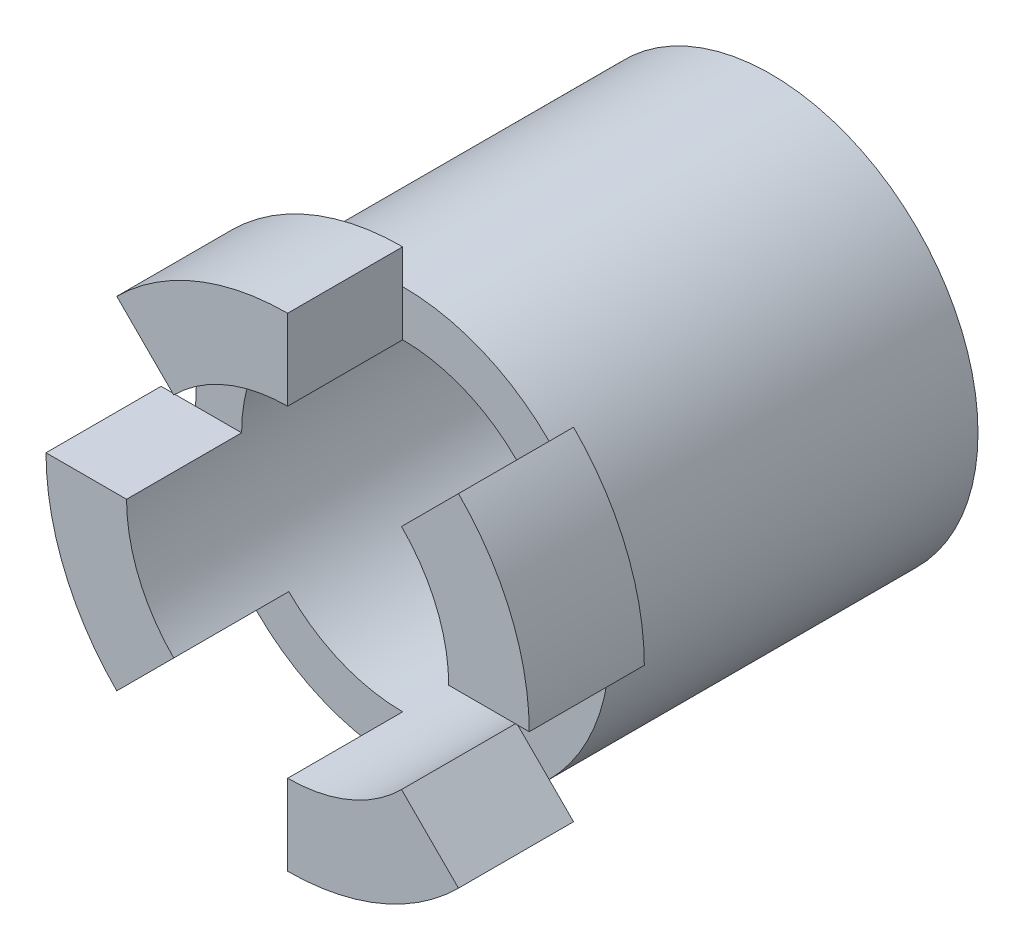
ISO-10303-21;
HEADER;
FILE_DESCRIPTION(('STEP AP214'),'2;1');
FILE_NAME('part.step','',(''),(''),'','','');
FILE_SCHEMA(('AUTOMOTIVE_DESIGN { 1 0 10303 214 1 1 1 1 }'));
ENDSEC;
DATA;
#1=APPLICATION_CONTEXT('core data for automotive mechanical design processes');
#2=APPLICATION_PROTOCOL_DEFINITION('international standard','automotive_design',2000,#1);
#3=PRODUCT_CONTEXT('',#1,'mechanical');
#4=PRODUCT('Part','Part','',(#3));
#5=PRODUCT_RELATED_PRODUCT_CATEGORY('part','',(#4));
#6=PRODUCT_DEFINITION_FORMATION('','',#4);
#7=PRODUCT_DEFINITION_CONTEXT('part definition',#1,'design');
#8=PRODUCT_DEFINITION('design','',#6,#7);
#9=PRODUCT_DEFINITION_SHAPE('','',#8);
#10=(LENGTH_UNIT() NAMED_UNIT(*) SI_UNIT(.MILLI.,.METRE.));
#11=(NAMED_UNIT(*) PLANE_ANGLE_UNIT() SI_UNIT($,.RADIAN.));
#12=(NAMED_UNIT(*) SI_UNIT($,.STERADIAN.) SOLID_ANGLE_UNIT());
#13=UNCERTAINTY_MEASURE_WITH_UNIT(LENGTH_MEASURE(1.E-05),#10,'distance_accuracy_value','');
#14=(GEOMETRIC_REPRESENTATION_CONTEXT(3) GLOBAL_UNCERTAINTY_ASSIGNED_CONTEXT((#13)) GLOBAL_UNIT_ASSIGNED_CONTEXT((#10,
#11,#12)) REPRESENTATION_CONTEXT('',''));
#15=CARTESIAN_POINT('',(0.,0.,0.));
#16=DIRECTION('',(0.,0.,1.));
#17=DIRECTION('',(1.,0.,0.));
#18=AXIS2_PLACEMENT_3D('',#15,#16,#17);
#19=CARTESIAN_POINT('',(0.,0.,8.));
#20=DIRECTION('',(0.,0.,1.));
#21=DIRECTION('',(1.,0.,0.));
#22=AXIS2_PLACEMENT_3D('',#19,#20,#21);
#23=PLANE('',#22);
#24=CARTESIAN_POINT('',(0.,0.,8.));
#25=DIRECTION('',(0.,0.,1.));
#26=DIRECTION('',(1.,0.,0.));
#27=AXIS2_PLACEMENT_3D('',#24,#25,#26);
#28=CIRCLE('',#27,3.5);
#29=CARTESIAN_POINT('',(2.4748737341529,2.47487373415293,8.));
#30=VERTEX_POINT('',#29);
#31=CARTESIAN_POINT('',(0.,3.5,8.));
#32=VERTEX_POINT('',#31);
#33=EDGE_CURVE('E343',#30,#32,#28,.T.);
#34=ORIENTED_EDGE('',*,*,#33,.F.);
#35=DIRECTION('',(-0.707106781186544,-0.707106781186551,0.));
#36=VECTOR('',#35,1.);
#37=CARTESIAN_POINT('',(2.4748737341529,2.47487373415293,8.));
#38=LINE('',#37,#36);
#39=CARTESIAN_POINT('',(3.18198051533944,3.18198051533948,8.));
#40=VERTEX_POINT('',#39);
#41=EDGE_CURVE('E696',#40,#30,#38,.T.);
#42=ORIENTED_EDGE('',*,*,#41,.F.);
#43=CARTESIAN_POINT('',(0.,0.,8.));
#44=DIRECTION('',(0.,0.,1.));
#45=DIRECTION('',(1.,0.,0.));
#46=AXIS2_PLACEMENT_3D('',#43,#44,#45);
#47=CIRCLE('',#46,4.5);
#48=CARTESIAN_POINT('',(0.,4.5,8.));
#49=VERTEX_POINT('',#48);
#50=EDGE_CURVE('E356',#40,#49,#47,.T.);
#51=ORIENTED_EDGE('',*,*,#50,.T.);
#52=DIRECTION('',(0.,1.,0.));
#53=VECTOR('',#52,1.);
#54=CARTESIAN_POINT('',(0.,5.25,8.));
#55=LINE('',#54,#53);
#56=EDGE_CURVE('E309',#32,#49,#55,.T.);
#57=ORIENTED_EDGE('',*,*,#56,.F.);
#58=EDGE_LOOP('',(#34,#42,#51,#57));
#59=FACE_BOUND('',#58,.T.);
#60=ADVANCED_FACE('F39',(#59),#23,.T.);
#61=CARTESIAN_POINT('',(3.18198051533946,-3.18198051533947,8.));
#62=VERTEX_POINT('',#61);
#63=CARTESIAN_POINT('',(4.5,0.,8.));
#64=VERTEX_POINT('',#63);
#65=EDGE_CURVE('E363',#62,#64,#47,.T.);
#66=ORIENTED_EDGE('',*,*,#65,.T.);
#67=DIRECTION('',(1.,0.,0.));
#68=VECTOR('',#67,1.);
#69=CARTESIAN_POINT('',(3.5,0.,8.));
#70=LINE('',#69,#68);
#71=CARTESIAN_POINT('',(3.5,0.,8.));
#72=VERTEX_POINT('',#71);
#73=EDGE_CURVE('E200',#72,#64,#70,.T.);
#74=ORIENTED_EDGE('',*,*,#73,.F.);
#75=CARTESIAN_POINT('',(2.47487373415291,-2.47487373415292,8.));
#76=VERTEX_POINT('',#75);
#77=EDGE_CURVE('E352',#76,#72,#28,.T.);
#78=ORIENTED_EDGE('',*,*,#77,.F.);
#79=DIRECTION('',(-0.707106781186546,0.707106781186549,0.));
#80=VECTOR('',#79,1.);
#81=CARTESIAN_POINT('',(2.47487373415291,-2.47487373415292,8.));
#82=LINE('',#81,#80);
#83=EDGE_CURVE('E277',#62,#76,#82,.T.);
#84=ORIENTED_EDGE('',*,*,#83,.F.);
#85=EDGE_LOOP('',(#66,#74,#78,#84));
#86=FACE_BOUND('',#85,.T.);
#87=ADVANCED_FACE('F399',(#86),#23,.T.);
#88=CARTESIAN_POINT('',(-2.4748737341529,-2.47487373415293,8.));
#89=VERTEX_POINT('',#88);
#90=CARTESIAN_POINT('',(0.,-3.5,8.));
#91=VERTEX_POINT('',#90);
#92=EDGE_CURVE('E351',#89,#91,#28,.T.);
#93=ORIENTED_EDGE('',*,*,#92,.F.);
#94=DIRECTION('',(0.707106781186544,0.707106781186551,0.));
#95=VECTOR('',#94,1.);
#96=CARTESIAN_POINT('',(-3.71231060122935,-3.7123106012294,8.));
#97=LINE('',#96,#95);
#98=CARTESIAN_POINT('',(-3.18198051533945,-3.18198051533948,8.));
#99=VERTEX_POINT('',#98);
#100=EDGE_CURVE('E234',#99,#89,#97,.T.);
#101=ORIENTED_EDGE('',*,*,#100,.F.);
#102=CARTESIAN_POINT('',(0.,-4.5,8.));
#103=VERTEX_POINT('',#102);
#104=EDGE_CURVE('E362',#99,#103,#47,.T.);
#105=ORIENTED_EDGE('',*,*,#104,.T.);
#106=DIRECTION('',(0.,-1.,0.));
#107=VECTOR('',#106,1.);
#108=CARTESIAN_POINT('',(0.,-3.5,8.));
#109=LINE('',#108,#107);
#110=EDGE_CURVE('E264',#91,#103,#109,.T.);
#111=ORIENTED_EDGE('',*,*,#110,.F.);
#112=EDGE_LOOP('',(#93,#101,#105,#111));
#113=FACE_BOUND('',#112,.T.);
#114=ADVANCED_FACE('F380',(#113),#23,.T.);
#115=CARTESIAN_POINT('',(-3.18198051533946,3.18198051533947,8.));
#116=VERTEX_POINT('',#115);
#117=CARTESIAN_POINT('',(-4.5,0.,8.));
#118=VERTEX_POINT('',#117);
#119=EDGE_CURVE('E355',#116,#118,#47,.T.);
#120=ORIENTED_EDGE('',*,*,#119,.T.);
#121=DIRECTION('',(-1.,0.,0.));
#122=VECTOR('',#121,1.);
#123=CARTESIAN_POINT('',(-5.25,0.,8.));
#124=LINE('',#123,#122);
#125=CARTESIAN_POINT('',(-3.5,0.,8.));
#126=VERTEX_POINT('',#125);
#127=EDGE_CURVE('E221',#126,#118,#124,.T.);
#128=ORIENTED_EDGE('',*,*,#127,.F.);
#129=CARTESIAN_POINT('',(-2.47487373415291,2.47487373415292,8.));
#130=VERTEX_POINT('',#129);
#131=EDGE_CURVE('E348',#130,#126,#28,.T.);
#132=ORIENTED_EDGE('',*,*,#131,.F.);
#133=DIRECTION('',(0.707106781186546,-0.707106781186549,0.));
#134=VECTOR('',#133,1.);
#135=CARTESIAN_POINT('',(-3.71231060122937,3.71231060122938,8.));
#136=LINE('',#135,#134);
#137=EDGE_CURVE('E11',#116,#130,#136,.T.);
#138=ORIENTED_EDGE('',*,*,#137,.F.);
#139=EDGE_LOOP('',(#120,#128,#132,#138));
#140=FACE_BOUND('',#139,.T.);
#141=ADVANCED_FACE('F432',(#140),#23,.T.);
#142=CARTESIAN_POINT('',(0.,0.,8.));
#143=DIRECTION('',(0.,0.,-1.));
#144=DIRECTION('',(-1.,0.,0.));
#145=AXIS2_PLACEMENT_3D('',#142,#143,#144);
#146=CYLINDRICAL_SURFACE('',#145,4.5);
#147=EDGE_CURVE('E49',#49,#116,#47,.T.);
#148=ORIENTED_EDGE('',*,*,#147,.F.);
#149=ORIENTED_EDGE('',*,*,#50,.F.);
#150=CARTESIAN_POINT('',(0.,0.,8.));
#151=DIRECTION('',(0.,0.,1.));
#152=DIRECTION('',(1.,0.,0.));
#153=AXIS2_PLACEMENT_3D('',#150,#151,#152);
#154=CIRCLE('',#153,4.5);
#155=EDGE_CURVE('E206',#64,#40,#154,.T.);
#156=ORIENTED_EDGE('',*,*,#155,.F.);
#157=ORIENTED_EDGE('',*,*,#65,.F.);
#158=CARTESIAN_POINT('',(0.,0.,8.));
#159=DIRECTION('',(0.,0.,1.));
#160=DIRECTION('',(1.,0.,0.));
#161=AXIS2_PLACEMENT_3D('',#158,#159,#160);
#162=CIRCLE('',#161,4.5);
#163=EDGE_CURVE('E300',#103,#62,#162,.T.);
#164=ORIENTED_EDGE('',*,*,#163,.F.);
#165=ORIENTED_EDGE('',*,*,#104,.F.);
#166=CARTESIAN_POINT('',(0.,0.,8.));
#167=DIRECTION('',(0.,0.,1.));
#168=DIRECTION('',(1.,0.,0.));
#169=AXIS2_PLACEMENT_3D('',#166,#167,#168);
#170=CIRCLE('',#169,4.5);
#171=EDGE_CURVE('E255',#118,#99,#170,.T.);
#172=ORIENTED_EDGE('',*,*,#171,.F.);
#173=ORIENTED_EDGE('',*,*,#119,.F.);
#174=EDGE_LOOP('',(#148,#149,#156,#157,#164,#165,#172,#173));
#175=FACE_BOUND('',#174,.T.);
#176=CARTESIAN_POINT('',(0.,0.,0.));
#177=DIRECTION('',(0.,0.,1.));
#178=DIRECTION('',(1.,0.,0.));
#179=AXIS2_PLACEMENT_3D('',#176,#177,#178);
#180=CIRCLE('',#179,4.5);
#181=CARTESIAN_POINT('',(4.5,0.,0.));
#182=VERTEX_POINT('',#181);
#183=EDGE_CURVE('E43',#182,#182,#180,.T.);
#184=ORIENTED_EDGE('',*,*,#183,.T.);
#185=EDGE_LOOP('',(#184));
#186=FACE_BOUND('',#185,.T.);
#187=ADVANCED_FACE('F41',(#175,#186),#146,.T.);
#188=CARTESIAN_POINT('',(0.,0.,0.));
#189=DIRECTION('',(0.,0.,1.));
#190=DIRECTION('',(1.,0.,0.));
#191=AXIS2_PLACEMENT_3D('',#188,#189,#190);
#192=PLANE('',#191);
#193=ORIENTED_EDGE('',*,*,#183,.F.);
#194=EDGE_LOOP('',(#193));
#195=FACE_BOUND('',#194,.T.);
#196=ADVANCED_FACE('F468',(#195),#192,.F.);
#197=CARTESIAN_POINT('',(0.,0.,1.5));
#198=DIRECTION('',(0.,0.,1.));
#199=DIRECTION('',(1.,0.,0.));
#200=AXIS2_PLACEMENT_3D('',#197,#198,#199);
#201=CYLINDRICAL_SURFACE('',#200,3.5);
#202=CARTESIAN_POINT('',(0.,0.,1.5));
#203=DIRECTION('',(0.,0.,1.));
#204=DIRECTION('',(1.,0.,0.));
#205=AXIS2_PLACEMENT_3D('',#202,#203,#204);
#206=CIRCLE('',#205,3.5);
#207=CARTESIAN_POINT('',(3.5,0.,1.5));
#208=VERTEX_POINT('',#207);
#209=EDGE_CURVE('E344',#208,#208,#206,.T.);
#210=ORIENTED_EDGE('',*,*,#209,.F.);
#211=EDGE_LOOP('',(#210));
#212=FACE_BOUND('',#211,.T.);
#213=ORIENTED_EDGE('',*,*,#131,.T.);
#214=DIRECTION('',(0.,0.,-1.));
#215=VECTOR('',#214,1.);
#216=CARTESIAN_POINT('',(-3.5,0.,10.5));
#217=LINE('',#216,#215);
#218=CARTESIAN_POINT('',(-3.5,0.,10.5));
#219=VERTEX_POINT('',#218);
#220=EDGE_CURVE('E246',#219,#126,#217,.T.);
#221=ORIENTED_EDGE('',*,*,#220,.F.);
#222=CARTESIAN_POINT('',(0.,0.,10.5));
#223=DIRECTION('',(0.,0.,-1.));
#224=DIRECTION('',(1.,0.,0.));
#225=AXIS2_PLACEMENT_3D('',#222,#223,#224);
#226=CIRCLE('',#225,3.5);
#227=CARTESIAN_POINT('',(-2.4748737341529,-2.47487373415293,10.5));
#228=VERTEX_POINT('',#227);
#229=EDGE_CURVE('E224',#228,#219,#226,.T.);
#230=ORIENTED_EDGE('',*,*,#229,.F.);
#231=DIRECTION('',(0.,0.,-1.));
#232=VECTOR('',#231,1.);
#233=CARTESIAN_POINT('',(-2.4748737341529,-2.47487373415293,10.5));
#234=LINE('',#233,#232);
#235=EDGE_CURVE('E65',#228,#89,#234,.T.);
#236=ORIENTED_EDGE('',*,*,#235,.T.);
#237=ORIENTED_EDGE('',*,*,#92,.T.);
#238=DIRECTION('',(0.,0.,-1.));
#239=VECTOR('',#238,1.);
#240=CARTESIAN_POINT('',(0.,-3.5,10.5));
#241=LINE('',#240,#239);
#242=CARTESIAN_POINT('',(0.,-3.5,10.5));
#243=VERTEX_POINT('',#242);
#244=EDGE_CURVE('E289',#243,#91,#241,.T.);
#245=ORIENTED_EDGE('',*,*,#244,.F.);
#246=CARTESIAN_POINT('',(0.,0.,10.5));
#247=DIRECTION('',(0.,0.,-1.));
#248=DIRECTION('',(1.,0.,0.));
#249=AXIS2_PLACEMENT_3D('',#246,#247,#248);
#250=CIRCLE('',#249,3.5);
#251=CARTESIAN_POINT('',(2.47487373415291,-2.47487373415292,10.5));
#252=VERTEX_POINT('',#251);
#253=EDGE_CURVE('E267',#252,#243,#250,.T.);
#254=ORIENTED_EDGE('',*,*,#253,.F.);
#255=DIRECTION('',(0.,0.,-1.));
#256=VECTOR('',#255,1.);
#257=CARTESIAN_POINT('',(2.47487373415291,-2.47487373415292,10.5));
#258=LINE('',#257,#256);
#259=EDGE_CURVE('E293',#252,#76,#258,.T.);
#260=ORIENTED_EDGE('',*,*,#259,.T.);
#261=ORIENTED_EDGE('',*,*,#77,.T.);
#262=DIRECTION('',(0.,0.,-1.));
#263=VECTOR('',#262,1.);
#264=CARTESIAN_POINT('',(3.5,0.,10.5));
#265=LINE('',#264,#263);
#266=CARTESIAN_POINT('',(3.5,0.,10.5));
#267=VERTEX_POINT('',#266);
#268=EDGE_CURVE('E212',#267,#72,#265,.T.);
#269=ORIENTED_EDGE('',*,*,#268,.F.);
#270=CARTESIAN_POINT('',(0.,0.,10.5));
#271=DIRECTION('',(0.,0.,-1.));
#272=DIRECTION('',(1.,0.,0.));
#273=AXIS2_PLACEMENT_3D('',#270,#271,#272);
#274=CIRCLE('',#273,3.5);
#275=CARTESIAN_POINT('',(2.4748737341529,2.47487373415293,10.5));
#276=VERTEX_POINT('',#275);
#277=EDGE_CURVE('E189',#276,#267,#274,.T.);
#278=ORIENTED_EDGE('',*,*,#277,.F.);
#279=DIRECTION('',(0.,0.,-1.));
#280=VECTOR('',#279,1.);
#281=CARTESIAN_POINT('',(2.4748737341529,2.47487373415293,10.5));
#282=LINE('',#281,#280);
#283=EDGE_CURVE('E58',#276,#30,#282,.T.);
#284=ORIENTED_EDGE('',*,*,#283,.T.);
#285=ORIENTED_EDGE('',*,*,#33,.T.);
#286=DIRECTION('',(0.,0.,-1.));
#287=VECTOR('',#286,1.);
#288=CARTESIAN_POINT('',(0.,3.5,10.5));
#289=LINE('',#288,#287);
#290=CARTESIAN_POINT('',(0.,3.5,10.5));
#291=VERTEX_POINT('',#290);
#292=EDGE_CURVE('E331',#291,#32,#289,.T.);
#293=ORIENTED_EDGE('',*,*,#292,.F.);
#294=CARTESIAN_POINT('',(0.,0.,10.5));
#295=DIRECTION('',(0.,0.,-1.));
#296=DIRECTION('',(1.,0.,0.));
#297=AXIS2_PLACEMENT_3D('',#294,#295,#296);
#298=CIRCLE('',#297,3.5);
#299=CARTESIAN_POINT('',(-2.47487373415291,2.47487373415292,10.5));
#300=VERTEX_POINT('',#299);
#301=EDGE_CURVE('E312',#300,#291,#298,.T.);
#302=ORIENTED_EDGE('',*,*,#301,.F.);
#303=DIRECTION('',(0.,0.,-1.));
#304=VECTOR('',#303,1.);
#305=CARTESIAN_POINT('',(-2.47487373415291,2.47487373415292,10.5));
#306=LINE('',#305,#304);
#307=EDGE_CURVE('E335',#300,#130,#306,.T.);
#308=ORIENTED_EDGE('',*,*,#307,.T.);
#309=EDGE_LOOP('',(#213,#221,#230,#236,#237,#245,#254,#260,#261,#269,#278,#284,#285,#293,#302,#308));
#310=FACE_BOUND('',#309,.T.);
#311=ADVANCED_FACE('F416',(#212,#310),#201,.F.);
#312=CARTESIAN_POINT('',(0.,0.,1.5));
#313=DIRECTION('',(0.,0.,1.));
#314=DIRECTION('',(1.,0.,0.));
#315=AXIS2_PLACEMENT_3D('',#312,#313,#314);
#316=PLANE('',#315);
#317=ORIENTED_EDGE('',*,*,#209,.T.);
#318=EDGE_LOOP('',(#317));
#319=FACE_BOUND('',#318,.T.);
#320=ADVANCED_FACE('F485',(#319),#316,.T.);
#321=CARTESIAN_POINT('',(0.,0.,8.));
#322=DIRECTION('',(0.,0.,1.));
#323=DIRECTION('',(1.,0.,0.));
#324=AXIS2_PLACEMENT_3D('',#321,#322,#323);
#325=PLANE('',#324);
#326=CARTESIAN_POINT('',(0.,5.25,8.));
#327=VERTEX_POINT('',#326);
#328=EDGE_CURVE('E324',#49,#327,#55,.T.);
#329=ORIENTED_EDGE('',*,*,#328,.F.);
#330=ORIENTED_EDGE('',*,*,#147,.T.);
#331=CARTESIAN_POINT('',(-3.71231060122937,3.71231060122938,8.));
#332=VERTEX_POINT('',#331);
#333=EDGE_CURVE('E51',#332,#116,#136,.T.);
#334=ORIENTED_EDGE('',*,*,#333,.F.);
#335=CARTESIAN_POINT('',(0.,0.,8.));
#336=DIRECTION('',(0.,0.,1.));
#337=DIRECTION('',(1.,0.,0.));
#338=AXIS2_PLACEMENT_3D('',#335,#336,#337);
#339=CIRCLE('',#338,5.25);
#340=EDGE_CURVE('E303',#327,#332,#339,.T.);
#341=ORIENTED_EDGE('',*,*,#340,.F.);
#342=EDGE_LOOP('',(#329,#330,#334,#341));
#343=FACE_BOUND('',#342,.T.);
#344=ADVANCED_FACE('F490',(#343),#325,.F.);
#345=CARTESIAN_POINT('',(0.,0.,10.5));
#346=DIRECTION('',(0.,0.,-1.));
#347=DIRECTION('',(-1.,0.,0.));
#348=AXIS2_PLACEMENT_3D('',#345,#346,#347);
#349=CYLINDRICAL_SURFACE('',#348,5.25);
#350=ORIENTED_EDGE('',*,*,#340,.T.);
#351=DIRECTION('',(0.,0.,-1.));
#352=VECTOR('',#351,1.);
#353=CARTESIAN_POINT('',(-3.71231060122937,3.71231060122938,10.5));
#354=LINE('',#353,#352);
#355=CARTESIAN_POINT('',(-3.71231060122937,3.71231060122938,10.5));
#356=VERTEX_POINT('',#355);
#357=EDGE_CURVE('E339',#356,#332,#354,.T.);
#358=ORIENTED_EDGE('',*,*,#357,.F.);
#359=CARTESIAN_POINT('',(0.,0.,10.5));
#360=DIRECTION('',(0.,0.,1.));
#361=DIRECTION('',(1.,0.,0.));
#362=AXIS2_PLACEMENT_3D('',#359,#360,#361);
#363=CIRCLE('',#362,5.25);
#364=CARTESIAN_POINT('',(0.,5.25,10.5));
#365=VERTEX_POINT('',#364);
#366=EDGE_CURVE('E304',#365,#356,#363,.T.);
#367=ORIENTED_EDGE('',*,*,#366,.F.);
#368=DIRECTION('',(0.,0.,-1.));
#369=VECTOR('',#368,1.);
#370=CARTESIAN_POINT('',(0.,5.25,10.5));
#371=LINE('',#370,#369);
#372=EDGE_CURVE('E318',#365,#327,#371,.T.);
#373=ORIENTED_EDGE('',*,*,#372,.T.);
#374=EDGE_LOOP('',(#350,#358,#367,#373));
#375=FACE_BOUND('',#374,.T.);
#376=ADVANCED_FACE('F523',(#375),#349,.T.);
#377=CARTESIAN_POINT('',(-3.71231060122937,3.71231060122938,10.5));
#378=DIRECTION('',(0.707106781186549,0.707106781186546,0.));
#379=DIRECTION('',(-0.707106781186546,0.707106781186549,0.));
#380=AXIS2_PLACEMENT_3D('',#377,#378,#379);
#381=PLANE('',#380);
#382=ORIENTED_EDGE('',*,*,#333,.T.);
#383=ORIENTED_EDGE('',*,*,#137,.T.);
#384=ORIENTED_EDGE('',*,*,#307,.F.);
#385=DIRECTION('',(0.707106781186546,-0.707106781186549,0.));
#386=VECTOR('',#385,1.);
#387=CARTESIAN_POINT('',(-3.71231060122937,3.71231060122938,10.5));
#388=LINE('',#387,#386);
#389=EDGE_CURVE('E308',#356,#300,#388,.T.);
#390=ORIENTED_EDGE('',*,*,#389,.F.);
#391=ORIENTED_EDGE('',*,*,#357,.T.);
#392=EDGE_LOOP('',(#382,#383,#384,#390,#391));
#393=FACE_BOUND('',#392,.T.);
#394=ADVANCED_FACE('F429',(#393),#381,.F.);
#395=CARTESIAN_POINT('',(0.,5.25,10.5));
#396=DIRECTION('',(-1.,0.,0.));
#397=DIRECTION('',(0.,0.,1.));
#398=AXIS2_PLACEMENT_3D('',#395,#396,#397);
#399=PLANE('',#398);
#400=ORIENTED_EDGE('',*,*,#56,.T.);
#401=ORIENTED_EDGE('',*,*,#328,.T.);
#402=ORIENTED_EDGE('',*,*,#372,.F.);
#403=DIRECTION('',(0.,1.,0.));
#404=VECTOR('',#403,1.);
#405=CARTESIAN_POINT('',(0.,5.25,10.5));
#406=LINE('',#405,#404);
#407=EDGE_CURVE('E315',#291,#365,#406,.T.);
#408=ORIENTED_EDGE('',*,*,#407,.F.);
#409=ORIENTED_EDGE('',*,*,#292,.T.);
#410=EDGE_LOOP('',(#400,#401,#402,#408,#409));
#411=FACE_BOUND('',#410,.T.);
#412=ADVANCED_FACE('F420',(#411),#399,.F.);
#413=CARTESIAN_POINT('',(0.,0.,10.5));
#414=DIRECTION('',(0.,0.,1.));
#415=DIRECTION('',(1.,0.,0.));
#416=AXIS2_PLACEMENT_3D('',#413,#414,#415);
#417=PLANE('',#416);
#418=ORIENTED_EDGE('',*,*,#366,.T.);
#419=ORIENTED_EDGE('',*,*,#389,.T.);
#420=ORIENTED_EDGE('',*,*,#301,.T.);
#421=ORIENTED_EDGE('',*,*,#407,.T.);
#422=EDGE_LOOP('',(#418,#419,#420,#421));
#423=FACE_BOUND('',#422,.T.);
#424=ADVANCED_FACE('F424',(#423),#417,.T.);
#425=CARTESIAN_POINT('',(0.,0.,8.));
#426=DIRECTION('',(0.,0.,1.));
#427=DIRECTION('',(1.,0.,0.));
#428=AXIS2_PLACEMENT_3D('',#425,#426,#427);
#429=PLANE('',#428);
#430=CARTESIAN_POINT('',(0.,-5.25,8.));
#431=VERTEX_POINT('',#430);
#432=EDGE_CURVE('E282',#103,#431,#109,.T.);
#433=ORIENTED_EDGE('',*,*,#432,.F.);
#434=ORIENTED_EDGE('',*,*,#163,.T.);
#435=CARTESIAN_POINT('',(3.71231060122937,-3.71231060122938,8.));
#436=VERTEX_POINT('',#435);
#437=EDGE_CURVE('E278',#436,#62,#82,.T.);
#438=ORIENTED_EDGE('',*,*,#437,.F.);
#439=CARTESIAN_POINT('',(0.,0.,8.));
#440=DIRECTION('',(0.,0.,1.));
#441=DIRECTION('',(1.,0.,0.));
#442=AXIS2_PLACEMENT_3D('',#439,#440,#441);
#443=CIRCLE('',#442,5.25);
#444=EDGE_CURVE('E258',#431,#436,#443,.T.);
#445=ORIENTED_EDGE('',*,*,#444,.F.);
#446=EDGE_LOOP('',(#433,#434,#438,#445));
#447=FACE_BOUND('',#446,.T.);
#448=ADVANCED_FACE('F386',(#447),#429,.F.);
#449=CARTESIAN_POINT('',(0.,0.,10.5));
#450=DIRECTION('',(0.,0.,-1.));
#451=DIRECTION('',(-1.,0.,0.));
#452=AXIS2_PLACEMENT_3D('',#449,#450,#451);
#453=CYLINDRICAL_SURFACE('',#452,5.25);
#454=ORIENTED_EDGE('',*,*,#444,.T.);
#455=DIRECTION('',(0.,0.,-1.));
#456=VECTOR('',#455,1.);
#457=CARTESIAN_POINT('',(3.71231060122937,-3.71231060122938,10.5));
#458=LINE('',#457,#456);
#459=CARTESIAN_POINT('',(3.71231060122937,-3.71231060122938,10.5));
#460=VERTEX_POINT('',#459);
#461=EDGE_CURVE('E296',#460,#436,#458,.T.);
#462=ORIENTED_EDGE('',*,*,#461,.F.);
#463=CARTESIAN_POINT('',(0.,0.,10.5));
#464=DIRECTION('',(0.,0.,1.));
#465=DIRECTION('',(1.,0.,0.));
#466=AXIS2_PLACEMENT_3D('',#463,#464,#465);
#467=CIRCLE('',#466,5.25);
#468=CARTESIAN_POINT('',(0.,-5.25,10.5));
#469=VERTEX_POINT('',#468);
#470=EDGE_CURVE('E259',#469,#460,#467,.T.);
#471=ORIENTED_EDGE('',*,*,#470,.F.);
#472=DIRECTION('',(0.,0.,-1.));
#473=VECTOR('',#472,1.);
#474=CARTESIAN_POINT('',(0.,-5.25,10.5));
#475=LINE('',#474,#473);
#476=EDGE_CURVE('E273',#469,#431,#475,.T.);
#477=ORIENTED_EDGE('',*,*,#476,.T.);
#478=EDGE_LOOP('',(#454,#462,#471,#477));
#479=FACE_BOUND('',#478,.T.);
#480=ADVANCED_FACE('F565',(#479),#453,.T.);
#481=CARTESIAN_POINT('',(2.47487373415291,-2.47487373415292,10.5));
#482=DIRECTION('',(-0.707106781186549,-0.707106781186546,0.));
#483=DIRECTION('',(0.707106781186546,-0.707106781186549,0.));
#484=AXIS2_PLACEMENT_3D('',#481,#482,#483);
#485=PLANE('',#484);
#486=ORIENTED_EDGE('',*,*,#437,.T.);
#487=ORIENTED_EDGE('',*,*,#83,.T.);
#488=ORIENTED_EDGE('',*,*,#259,.F.);
#489=DIRECTION('',(-0.707106781186546,0.707106781186549,0.));
#490=VECTOR('',#489,1.);
#491=CARTESIAN_POINT('',(2.47487373415291,-2.47487373415292,10.5));
#492=LINE('',#491,#490);
#493=EDGE_CURVE('E263',#460,#252,#492,.T.);
#494=ORIENTED_EDGE('',*,*,#493,.F.);
#495=ORIENTED_EDGE('',*,*,#461,.T.);
#496=EDGE_LOOP('',(#486,#487,#488,#494,#495));
#497=FACE_BOUND('',#496,.T.);
#498=ADVANCED_FACE('F574',(#497),#485,.F.);
#499=CARTESIAN_POINT('',(0.,-3.5,10.5));
#500=DIRECTION('',(1.,0.,0.));
#501=DIRECTION('',(0.,0.,-1.));
#502=AXIS2_PLACEMENT_3D('',#499,#500,#501);
#503=PLANE('',#502);
#504=ORIENTED_EDGE('',*,*,#110,.T.);
#505=ORIENTED_EDGE('',*,*,#432,.T.);
#506=ORIENTED_EDGE('',*,*,#476,.F.);
#507=DIRECTION('',(0.,-1.,0.));
#508=VECTOR('',#507,1.);
#509=CARTESIAN_POINT('',(0.,-3.5,10.5));
#510=LINE('',#509,#508);
#511=EDGE_CURVE('E270',#243,#469,#510,.T.);
#512=ORIENTED_EDGE('',*,*,#511,.F.);
#513=ORIENTED_EDGE('',*,*,#244,.T.);
#514=EDGE_LOOP('',(#504,#505,#506,#512,#513));
#515=FACE_BOUND('',#514,.T.);
#516=ADVANCED_FACE('F390',(#515),#503,.F.);
#517=CARTESIAN_POINT('',(0.,0.,10.5));
#518=DIRECTION('',(0.,0.,1.));
#519=DIRECTION('',(1.,0.,0.));
#520=AXIS2_PLACEMENT_3D('',#517,#518,#519);
#521=PLANE('',#520);
#522=ORIENTED_EDGE('',*,*,#470,.T.);
#523=ORIENTED_EDGE('',*,*,#493,.T.);
#524=ORIENTED_EDGE('',*,*,#253,.T.);
#525=ORIENTED_EDGE('',*,*,#511,.T.);
#526=EDGE_LOOP('',(#522,#523,#524,#525));
#527=FACE_BOUND('',#526,.T.);
#528=ADVANCED_FACE('F454',(#527),#521,.T.);
#529=CARTESIAN_POINT('',(0.,0.,8.));
#530=DIRECTION('',(0.,0.,1.));
#531=DIRECTION('',(1.,0.,0.));
#532=AXIS2_PLACEMENT_3D('',#529,#530,#531);
#533=PLANE('',#532);
#534=CARTESIAN_POINT('',(-5.25,0.,8.));
#535=VERTEX_POINT('',#534);
#536=EDGE_CURVE('E239',#118,#535,#124,.T.);
#537=ORIENTED_EDGE('',*,*,#536,.F.);
#538=ORIENTED_EDGE('',*,*,#171,.T.);
#539=CARTESIAN_POINT('',(-3.71231060122935,-3.7123106012294,8.));
#540=VERTEX_POINT('',#539);
#541=EDGE_CURVE('E235',#540,#99,#97,.T.);
#542=ORIENTED_EDGE('',*,*,#541,.F.);
#543=CARTESIAN_POINT('',(0.,0.,8.));
#544=DIRECTION('',(0.,0.,1.));
#545=DIRECTION('',(1.,0.,0.));
#546=AXIS2_PLACEMENT_3D('',#543,#544,#545);
#547=CIRCLE('',#546,5.25);
#548=EDGE_CURVE('E210',#535,#540,#547,.T.);
#549=ORIENTED_EDGE('',*,*,#548,.F.);
#550=EDGE_LOOP('',(#537,#538,#542,#549));
#551=FACE_BOUND('',#550,.T.);
#552=ADVANCED_FACE('F435',(#551),#533,.F.);
#553=CARTESIAN_POINT('',(0.,0.,10.5));
#554=DIRECTION('',(0.,0.,-1.));
#555=DIRECTION('',(-1.,0.,0.));
#556=AXIS2_PLACEMENT_3D('',#553,#554,#555);
#557=CYLINDRICAL_SURFACE('',#556,5.25);
#558=ORIENTED_EDGE('',*,*,#548,.T.);
#559=DIRECTION('',(0.,0.,-1.));
#560=VECTOR('',#559,1.);
#561=CARTESIAN_POINT('',(-3.71231060122935,-3.7123106012294,10.5));
#562=LINE('',#561,#560);
#563=CARTESIAN_POINT('',(-3.71231060122935,-3.7123106012294,10.5));
#564=VERTEX_POINT('',#563);
#565=EDGE_CURVE('E251',#564,#540,#562,.T.);
#566=ORIENTED_EDGE('',*,*,#565,.F.);
#567=CARTESIAN_POINT('',(0.,0.,10.5));
#568=DIRECTION('',(0.,0.,1.));
#569=DIRECTION('',(1.,0.,0.));
#570=AXIS2_PLACEMENT_3D('',#567,#568,#569);
#571=CIRCLE('',#570,5.25);
#572=CARTESIAN_POINT('',(-5.25,0.,10.5));
#573=VERTEX_POINT('',#572);
#574=EDGE_CURVE('E216',#573,#564,#571,.T.);
#575=ORIENTED_EDGE('',*,*,#574,.F.);
#576=DIRECTION('',(0.,0.,-1.));
#577=VECTOR('',#576,1.);
#578=CARTESIAN_POINT('',(-5.25,0.,10.5));
#579=LINE('',#578,#577);
#580=EDGE_CURVE('E230',#573,#535,#579,.T.);
#581=ORIENTED_EDGE('',*,*,#580,.T.);
#582=EDGE_LOOP('',(#558,#566,#575,#581));
#583=FACE_BOUND('',#582,.T.);
#584=ADVANCED_FACE('F446',(#583),#557,.T.);
#585=CARTESIAN_POINT('',(-3.71231060122935,-3.7123106012294,10.5));
#586=DIRECTION('',(-0.707106781186551,0.707106781186544,0.));
#587=DIRECTION('',(-0.707106781186544,-0.707106781186551,0.));
#588=AXIS2_PLACEMENT_3D('',#585,#586,#587);
#589=PLANE('',#588);
#590=ORIENTED_EDGE('',*,*,#541,.T.);
#591=ORIENTED_EDGE('',*,*,#100,.T.);
#592=ORIENTED_EDGE('',*,*,#235,.F.);
#593=DIRECTION('',(0.707106781186544,0.707106781186551,0.));
#594=VECTOR('',#593,1.);
#595=CARTESIAN_POINT('',(-3.71231060122935,-3.7123106012294,10.5));
#596=LINE('',#595,#594);
#597=EDGE_CURVE('E220',#564,#228,#596,.T.);
#598=ORIENTED_EDGE('',*,*,#597,.F.);
#599=ORIENTED_EDGE('',*,*,#565,.T.);
#600=EDGE_LOOP('',(#590,#591,#592,#598,#599));
#601=FACE_BOUND('',#600,.T.);
#602=ADVANCED_FACE('F410',(#601),#589,.F.);
#603=CARTESIAN_POINT('',(-5.25,0.,10.5));
#604=DIRECTION('',(0.,-1.,0.));
#605=DIRECTION('',(0.,0.,-1.));
#606=AXIS2_PLACEMENT_3D('',#603,#604,#605);
#607=PLANE('',#606);
#608=ORIENTED_EDGE('',*,*,#127,.T.);
#609=ORIENTED_EDGE('',*,*,#536,.T.);
#610=ORIENTED_EDGE('',*,*,#580,.F.);
#611=DIRECTION('',(-1.,0.,0.));
#612=VECTOR('',#611,1.);
#613=CARTESIAN_POINT('',(-5.25,0.,10.5));
#614=LINE('',#613,#612);
#615=EDGE_CURVE('E227',#219,#573,#614,.T.);
#616=ORIENTED_EDGE('',*,*,#615,.F.);
#617=ORIENTED_EDGE('',*,*,#220,.T.);
#618=EDGE_LOOP('',(#608,#609,#610,#616,#617));
#619=FACE_BOUND('',#618,.T.);
#620=ADVANCED_FACE('F439',(#619),#607,.F.);
#621=CARTESIAN_POINT('',(0.,0.,10.5));
#622=DIRECTION('',(0.,0.,1.));
#623=DIRECTION('',(1.,0.,0.));
#624=AXIS2_PLACEMENT_3D('',#621,#622,#623);
#625=PLANE('',#624);
#626=ORIENTED_EDGE('',*,*,#574,.T.);
#627=ORIENTED_EDGE('',*,*,#597,.T.);
#628=ORIENTED_EDGE('',*,*,#229,.T.);
#629=ORIENTED_EDGE('',*,*,#615,.T.);
#630=EDGE_LOOP('',(#626,#627,#628,#629));
#631=FACE_BOUND('',#630,.T.);
#632=ADVANCED_FACE('F442',(#631),#625,.T.);
#633=CARTESIAN_POINT('',(0.,0.,8.));
#634=DIRECTION('',(0.,0.,1.));
#635=DIRECTION('',(1.,0.,0.));
#636=AXIS2_PLACEMENT_3D('',#633,#634,#635);
#637=PLANE('',#636);
#638=CARTESIAN_POINT('',(5.25,0.,8.));
#639=VERTEX_POINT('',#638);
#640=EDGE_CURVE('E679',#64,#639,#70,.T.);
#641=ORIENTED_EDGE('',*,*,#640,.F.);
#642=ORIENTED_EDGE('',*,*,#155,.T.);
#643=CARTESIAN_POINT('',(3.71231060122935,3.7123106012294,8.));
#644=VERTEX_POINT('',#643);
#645=EDGE_CURVE('E684',#644,#40,#38,.T.);
#646=ORIENTED_EDGE('',*,*,#645,.F.);
#647=CARTESIAN_POINT('',(0.,0.,8.));
#648=DIRECTION('',(0.,0.,1.));
#649=DIRECTION('',(1.,0.,0.));
#650=AXIS2_PLACEMENT_3D('',#647,#648,#649);
#651=CIRCLE('',#650,5.25);
#652=EDGE_CURVE('E204',#639,#644,#651,.T.);
#653=ORIENTED_EDGE('',*,*,#652,.F.);
#654=EDGE_LOOP('',(#641,#642,#646,#653));
#655=FACE_BOUND('',#654,.T.);
#656=ADVANCED_FACE('F632',(#655),#637,.F.);
#657=CARTESIAN_POINT('',(0.,0.,10.5));
#658=DIRECTION('',(0.,0.,-1.));
#659=DIRECTION('',(-1.,0.,0.));
#660=AXIS2_PLACEMENT_3D('',#657,#658,#659);
#661=CYLINDRICAL_SURFACE('',#660,5.25);
#662=ORIENTED_EDGE('',*,*,#652,.T.);
#663=DIRECTION('',(0.,0.,-1.));
#664=VECTOR('',#663,1.);
#665=CARTESIAN_POINT('',(3.71231060122935,3.7123106012294,10.5));
#666=LINE('',#665,#664);
#667=CARTESIAN_POINT('',(3.71231060122935,3.7123106012294,10.5));
#668=VERTEX_POINT('',#667);
#669=EDGE_CURVE('E185',#668,#644,#666,.T.);
#670=ORIENTED_EDGE('',*,*,#669,.F.);
#671=CARTESIAN_POINT('',(0.,0.,10.5));
#672=DIRECTION('',(0.,0.,1.));
#673=DIRECTION('',(1.,0.,0.));
#674=AXIS2_PLACEMENT_3D('',#671,#672,#673);
#675=CIRCLE('',#674,5.25);
#676=CARTESIAN_POINT('',(5.25,0.,10.5));
#677=VERTEX_POINT('',#676);
#678=EDGE_CURVE('E190',#677,#668,#675,.T.);
#679=ORIENTED_EDGE('',*,*,#678,.F.);
#680=DIRECTION('',(0.,0.,-1.));
#681=VECTOR('',#680,1.);
#682=CARTESIAN_POINT('',(5.25,0.,10.5));
#683=LINE('',#682,#681);
#684=EDGE_CURVE('E688',#677,#639,#683,.T.);
#685=ORIENTED_EDGE('',*,*,#684,.T.);
#686=EDGE_LOOP('',(#662,#670,#679,#685));
#687=FACE_BOUND('',#686,.T.);
#688=ADVANCED_FACE('F202',(#687),#661,.T.);
#689=CARTESIAN_POINT('',(2.4748737341529,2.47487373415293,10.5));
#690=DIRECTION('',(0.707106781186551,-0.707106781186544,0.));
#691=DIRECTION('',(0.707106781186544,0.707106781186551,0.));
#692=AXIS2_PLACEMENT_3D('',#689,#690,#691);
#693=PLANE('',#692);
#694=ORIENTED_EDGE('',*,*,#645,.T.);
#695=ORIENTED_EDGE('',*,*,#41,.T.);
#696=ORIENTED_EDGE('',*,*,#283,.F.);
#697=DIRECTION('',(-0.707106781186544,-0.707106781186551,0.));
#698=VECTOR('',#697,1.);
#699=CARTESIAN_POINT('',(2.4748737341529,2.47487373415293,10.5));
#700=LINE('',#699,#698);
#701=EDGE_CURVE('E180',#668,#276,#700,.T.);
#702=ORIENTED_EDGE('',*,*,#701,.F.);
#703=ORIENTED_EDGE('',*,*,#669,.T.);
#704=EDGE_LOOP('',(#694,#695,#696,#702,#703));
#705=FACE_BOUND('',#704,.T.);
#706=ADVANCED_FACE('F183',(#705),#693,.F.);
#707=CARTESIAN_POINT('',(3.5,0.,10.5));
#708=DIRECTION('',(0.,1.,0.));
#709=DIRECTION('',(0.,0.,1.));
#710=AXIS2_PLACEMENT_3D('',#707,#708,#709);
#711=PLANE('',#710);
#712=ORIENTED_EDGE('',*,*,#73,.T.);
#713=ORIENTED_EDGE('',*,*,#640,.T.);
#714=ORIENTED_EDGE('',*,*,#684,.F.);
#715=DIRECTION('',(1.,0.,0.));
#716=VECTOR('',#715,1.);
#717=CARTESIAN_POINT('',(3.5,0.,10.5));
#718=LINE('',#717,#716);
#719=EDGE_CURVE('E195',#267,#677,#718,.T.);
#720=ORIENTED_EDGE('',*,*,#719,.F.);
#721=ORIENTED_EDGE('',*,*,#268,.T.);
#722=EDGE_LOOP('',(#712,#713,#714,#720,#721));
#723=FACE_BOUND('',#722,.T.);
#724=ADVANCED_FACE('F658',(#723),#711,.F.);
#725=CARTESIAN_POINT('',(0.,0.,10.5));
#726=DIRECTION('',(0.,0.,1.));
#727=DIRECTION('',(1.,0.,0.));
#728=AXIS2_PLACEMENT_3D('',#725,#726,#727);
#729=PLANE('',#728);
#730=ORIENTED_EDGE('',*,*,#678,.T.);
#731=ORIENTED_EDGE('',*,*,#701,.T.);
#732=ORIENTED_EDGE('',*,*,#277,.T.);
#733=ORIENTED_EDGE('',*,*,#719,.T.);
#734=EDGE_LOOP('',(#730,#731,#732,#733));
#735=FACE_BOUND('',#734,.T.);
#736=ADVANCED_FACE('F193',(#735),#729,.T.);
#737=CLOSED_SHELL('',(#60,#87,#114,#141,#187,#196,#311,#320,#344,#376,#394,#412,#424,#448,#480,
#498,#516,#528,#552,#584,#602,#620,#632,#656,#688,#706,#724,#736));
#738=MANIFOLD_SOLID_BREP('B2',#737);
#739=ADVANCED_BREP_SHAPE_REPRESENTATION('',(#18,#738),#14);
#740=SHAPE_DEFINITION_REPRESENTATION(#9,#739);
ENDSEC;
END-ISO-10303-21;
